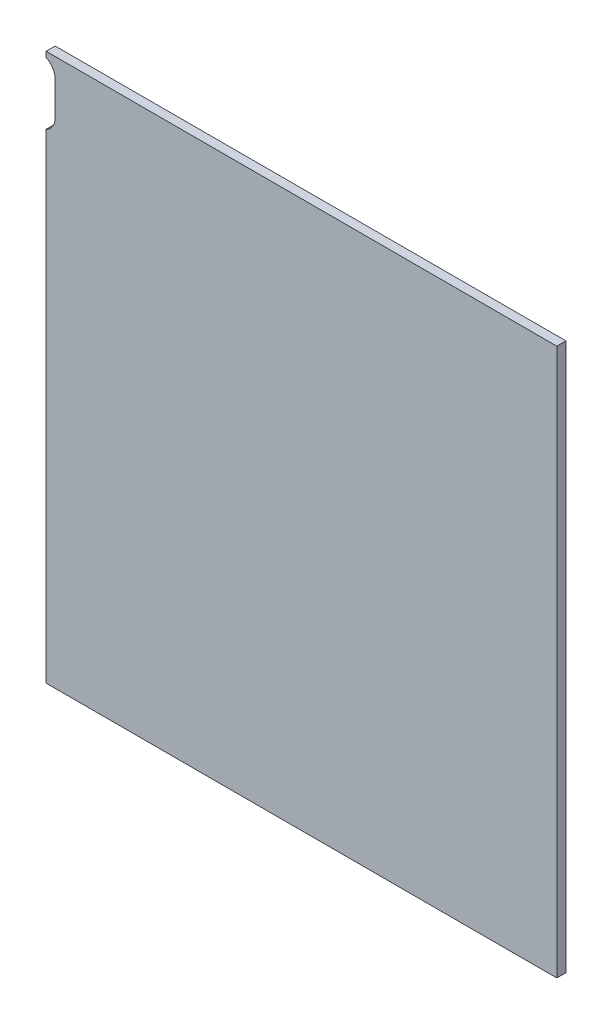
ISO-10303-21;
HEADER;
FILE_DESCRIPTION(('STEP AP214'),'2;1');
FILE_NAME('part.step','',(''),(''),'','','');
FILE_SCHEMA(('AUTOMOTIVE_DESIGN { 1 0 10303 214 1 1 1 1 }'));
ENDSEC;
DATA;
#1=APPLICATION_CONTEXT('core data for automotive mechanical design processes');
#2=APPLICATION_PROTOCOL_DEFINITION('international standard','automotive_design',2000,#1);
#3=PRODUCT_CONTEXT('',#1,'mechanical');
#4=PRODUCT('Part','Part','',(#3));
#5=PRODUCT_RELATED_PRODUCT_CATEGORY('part','',(#4));
#6=PRODUCT_DEFINITION_FORMATION('','',#4);
#7=PRODUCT_DEFINITION_CONTEXT('part definition',#1,'design');
#8=PRODUCT_DEFINITION('design','',#6,#7);
#9=PRODUCT_DEFINITION_SHAPE('','',#8);
#10=(LENGTH_UNIT() NAMED_UNIT(*) SI_UNIT(.MILLI.,.METRE.));
#11=(NAMED_UNIT(*) PLANE_ANGLE_UNIT() SI_UNIT($,.RADIAN.));
#12=(NAMED_UNIT(*) SI_UNIT($,.STERADIAN.) SOLID_ANGLE_UNIT());
#13=UNCERTAINTY_MEASURE_WITH_UNIT(LENGTH_MEASURE(1.E-05),#10,'distance_accuracy_value','');
#14=(GEOMETRIC_REPRESENTATION_CONTEXT(3) GLOBAL_UNCERTAINTY_ASSIGNED_CONTEXT((#13)) GLOBAL_UNIT_ASSIGNED_CONTEXT((#10,
#11,#12)) REPRESENTATION_CONTEXT('',''));
#15=CARTESIAN_POINT('',(0.,0.,0.));
#16=DIRECTION('',(0.,0.,1.));
#17=DIRECTION('',(1.,0.,0.));
#18=AXIS2_PLACEMENT_3D('',#15,#16,#17);
#19=CARTESIAN_POINT('',(0.,0.,0.));
#20=DIRECTION('',(0.,0.,-1.));
#21=DIRECTION('',(-1.,0.,0.));
#22=AXIS2_PLACEMENT_3D('',#19,#20,#21);
#23=PLANE('',#22);
#24=CARTESIAN_POINT('',(-144.,139.,0.));
#25=DIRECTION('',(0.,0.,1.));
#26=DIRECTION('',(1.,0.,0.));
#27=AXIS2_PLACEMENT_3D('',#24,#25,#26);
#28=CIRCLE('',#27,9.00000000000001);
#29=CARTESIAN_POINT('',(-135.,139.,0.));
#30=VERTEX_POINT('',#29);
#31=CARTESIAN_POINT('',(-140.,147.062257748299,0.));
#32=VERTEX_POINT('',#31);
#33=EDGE_CURVE('E185',#30,#32,#28,.T.);
#34=ORIENTED_EDGE('',*,*,#33,.T.);
#35=DIRECTION('',(0.,-1.,0.));
#36=VECTOR('',#35,1.);
#37=CARTESIAN_POINT('',(-140.,-150.,0.));
#38=LINE('',#37,#36);
#39=CARTESIAN_POINT('',(-140.,150.,0.));
#40=VERTEX_POINT('',#39);
#41=EDGE_CURVE('E224',#40,#32,#38,.T.);
#42=ORIENTED_EDGE('',*,*,#41,.F.);
#43=DIRECTION('',(-1.,0.,0.));
#44=VECTOR('',#43,1.);
#45=CARTESIAN_POINT('',(-140.,150.,0.));
#46=LINE('',#45,#44);
#47=CARTESIAN_POINT('',(140.,150.,0.));
#48=VERTEX_POINT('',#47);
#49=EDGE_CURVE('E221',#48,#40,#46,.T.);
#50=ORIENTED_EDGE('',*,*,#49,.F.);
#51=DIRECTION('',(0.,1.,0.));
#52=VECTOR('',#51,1.);
#53=CARTESIAN_POINT('',(140.,-150.,0.));
#54=LINE('',#53,#52);
#55=CARTESIAN_POINT('',(140.,-150.,0.));
#56=VERTEX_POINT('',#55);
#57=EDGE_CURVE('E205',#56,#48,#54,.T.);
#58=ORIENTED_EDGE('',*,*,#57,.F.);
#59=DIRECTION('',(1.,0.,0.));
#60=VECTOR('',#59,1.);
#61=CARTESIAN_POINT('',(-140.,-150.,0.));
#62=LINE('',#61,#60);
#63=CARTESIAN_POINT('',(-140.,-150.,0.));
#64=VERTEX_POINT('',#63);
#65=EDGE_CURVE('E210',#64,#56,#62,.T.);
#66=ORIENTED_EDGE('',*,*,#65,.F.);
#67=CARTESIAN_POINT('',(-140.,112.937742251701,0.));
#68=VERTEX_POINT('',#67);
#69=EDGE_CURVE('E223',#68,#64,#38,.T.);
#70=ORIENTED_EDGE('',*,*,#69,.F.);
#71=CARTESIAN_POINT('',(-144.,121.,0.));
#72=DIRECTION('',(0.,0.,-1.));
#73=DIRECTION('',(-1.,0.,0.));
#74=AXIS2_PLACEMENT_3D('',#71,#72,#73);
#75=CIRCLE('',#74,9.00000000000001);
#76=CARTESIAN_POINT('',(-135.,121.,0.));
#77=VERTEX_POINT('',#76);
#78=EDGE_CURVE('E11',#77,#68,#75,.T.);
#79=ORIENTED_EDGE('',*,*,#78,.F.);
#80=DIRECTION('',(0.,1.,0.));
#81=VECTOR('',#80,1.);
#82=CARTESIAN_POINT('',(-135.,139.,0.));
#83=LINE('',#82,#81);
#84=EDGE_CURVE('E56',#77,#30,#83,.T.);
#85=ORIENTED_EDGE('',*,*,#84,.T.);
#86=EDGE_LOOP('',(#34,#42,#50,#58,#66,#70,#79,#85));
#87=FACE_BOUND('',#86,.T.);
#88=DIRECTION('',(-0.976771023655525,-0.214285714285714,0.));
#89=VECTOR('',#88,1.);
#90=CARTESIAN_POINT('',(85.,-111.267710236555,0.));
#91=LINE('',#90,#89);
#92=CARTESIAN_POINT('',(85.,-111.267710236555,0.));
#93=VERTEX_POINT('',#92);
#94=CARTESIAN_POINT('',(16.6260283441133,-126.267710236555,0.));
#95=VERTEX_POINT('',#94);
#96=EDGE_CURVE('E163',#93,#95,#91,.T.);
#97=ORIENTED_EDGE('',*,*,#96,.F.);
#98=DIRECTION('',(0.214285714285715,-0.976771023655524,0.));
#99=VECTOR('',#98,1.);
#100=CARTESIAN_POINT('',(82.8571428571429,-101.5,0.));
#101=LINE('',#100,#99);
#102=CARTESIAN_POINT('',(82.8571428571429,-101.5,0.));
#103=VERTEX_POINT('',#102);
#104=EDGE_CURVE('E161',#103,#93,#101,.T.);
#105=ORIENTED_EDGE('',*,*,#104,.F.);
#106=DIRECTION('',(0.976771023655525,0.214285714285714,0.));
#107=VECTOR('',#106,1.);
#108=CARTESIAN_POINT('',(82.8571428571429,-101.5,0.));
#109=LINE('',#108,#107);
#110=CARTESIAN_POINT('',(14.4831712012562,-116.5,0.));
#111=VERTEX_POINT('',#110);
#112=EDGE_CURVE('E171',#111,#103,#109,.T.);
#113=ORIENTED_EDGE('',*,*,#112,.F.);
#114=DIRECTION('',(-0.214285714285713,0.976771023655525,0.));
#115=VECTOR('',#114,1.);
#116=CARTESIAN_POINT('',(14.4831712012562,-116.5,0.));
#117=LINE('',#116,#115);
#118=EDGE_CURVE('E174',#95,#111,#117,.T.);
#119=ORIENTED_EDGE('',*,*,#118,.F.);
#120=EDGE_LOOP('',(#97,#105,#113,#119));
#121=FACE_BOUND('',#120,.T.);
#122=ADVANCED_FACE('F33',(#87,#121),#23,.T.);
#123=CARTESIAN_POINT('',(-140.,-150.,5.));
#124=DIRECTION('',(1.,0.,0.));
#125=DIRECTION('',(0.,0.,-1.));
#126=AXIS2_PLACEMENT_3D('',#123,#124,#125);
#127=PLANE('',#126);
#128=ORIENTED_EDGE('',*,*,#41,.T.);
#129=DIRECTION('',(0.,0.,1.));
#130=VECTOR('',#129,1.);
#131=CARTESIAN_POINT('',(-140.,147.062257748299,0.));
#132=LINE('',#131,#130);
#133=CARTESIAN_POINT('',(-140.,147.062257748299,5.));
#134=VERTEX_POINT('',#133);
#135=EDGE_CURVE('E202',#32,#134,#132,.T.);
#136=ORIENTED_EDGE('',*,*,#135,.T.);
#137=DIRECTION('',(0.,-1.,0.));
#138=VECTOR('',#137,1.);
#139=CARTESIAN_POINT('',(-140.,-150.,5.));
#140=LINE('',#139,#138);
#141=CARTESIAN_POINT('',(-140.,150.,5.));
#142=VERTEX_POINT('',#141);
#143=EDGE_CURVE('E213',#142,#134,#140,.T.);
#144=ORIENTED_EDGE('',*,*,#143,.F.);
#145=DIRECTION('',(0.,0.,-1.));
#146=VECTOR('',#145,1.);
#147=CARTESIAN_POINT('',(-140.,150.,5.));
#148=LINE('',#147,#146);
#149=EDGE_CURVE('E233',#142,#40,#148,.T.);
#150=ORIENTED_EDGE('',*,*,#149,.T.);
#151=EDGE_LOOP('',(#128,#136,#144,#150));
#152=FACE_BOUND('',#151,.T.);
#153=ADVANCED_FACE('F251',(#152),#127,.F.);
#154=CARTESIAN_POINT('',(140.,-150.,5.));
#155=DIRECTION('',(-1.,0.,0.));
#156=DIRECTION('',(0.,0.,1.));
#157=AXIS2_PLACEMENT_3D('',#154,#155,#156);
#158=PLANE('',#157);
#159=ORIENTED_EDGE('',*,*,#57,.T.);
#160=DIRECTION('',(0.,0.,-1.));
#161=VECTOR('',#160,1.);
#162=CARTESIAN_POINT('',(140.,150.,5.));
#163=LINE('',#162,#161);
#164=CARTESIAN_POINT('',(140.,150.,5.));
#165=VERTEX_POINT('',#164);
#166=EDGE_CURVE('E41',#165,#48,#163,.T.);
#167=ORIENTED_EDGE('',*,*,#166,.F.);
#168=DIRECTION('',(0.,1.,0.));
#169=VECTOR('',#168,1.);
#170=CARTESIAN_POINT('',(140.,-150.,5.));
#171=LINE('',#170,#169);
#172=CARTESIAN_POINT('',(140.,-150.,5.));
#173=VERTEX_POINT('',#172);
#174=EDGE_CURVE('E206',#173,#165,#171,.T.);
#175=ORIENTED_EDGE('',*,*,#174,.F.);
#176=DIRECTION('',(0.,0.,-1.));
#177=VECTOR('',#176,1.);
#178=CARTESIAN_POINT('',(140.,-150.,5.));
#179=LINE('',#178,#177);
#180=EDGE_CURVE('E218',#173,#56,#179,.T.);
#181=ORIENTED_EDGE('',*,*,#180,.T.);
#182=EDGE_LOOP('',(#159,#167,#175,#181));
#183=FACE_BOUND('',#182,.T.);
#184=ADVANCED_FACE('F35',(#183),#158,.F.);
#185=CARTESIAN_POINT('',(-140.,150.,5.));
#186=DIRECTION('',(0.,-1.,0.));
#187=DIRECTION('',(0.,0.,-1.));
#188=AXIS2_PLACEMENT_3D('',#185,#186,#187);
#189=PLANE('',#188);
#190=ORIENTED_EDGE('',*,*,#49,.T.);
#191=ORIENTED_EDGE('',*,*,#149,.F.);
#192=DIRECTION('',(-1.,0.,0.));
#193=VECTOR('',#192,1.);
#194=CARTESIAN_POINT('',(-140.,150.,5.));
#195=LINE('',#194,#193);
#196=EDGE_CURVE('E209',#165,#142,#195,.T.);
#197=ORIENTED_EDGE('',*,*,#196,.F.);
#198=ORIENTED_EDGE('',*,*,#166,.T.);
#199=EDGE_LOOP('',(#190,#191,#197,#198));
#200=FACE_BOUND('',#199,.T.);
#201=ADVANCED_FACE('F238',(#200),#189,.F.);
#202=CARTESIAN_POINT('',(-140.,112.937742251701,5.));
#203=VERTEX_POINT('',#202);
#204=CARTESIAN_POINT('',(-140.,-150.,5.));
#205=VERTEX_POINT('',#204);
#206=EDGE_CURVE('E212',#203,#205,#140,.T.);
#207=ORIENTED_EDGE('',*,*,#206,.F.);
#208=DIRECTION('',(0.,0.,1.));
#209=VECTOR('',#208,1.);
#210=CARTESIAN_POINT('',(-140.,112.937742251701,0.));
#211=LINE('',#210,#209);
#212=EDGE_CURVE('E198',#203,#68,#211,.F.);
#213=ORIENTED_EDGE('',*,*,#212,.T.);
#214=ORIENTED_EDGE('',*,*,#69,.T.);
#215=DIRECTION('',(0.,0.,-1.));
#216=VECTOR('',#215,1.);
#217=CARTESIAN_POINT('',(-140.,-150.,5.));
#218=LINE('',#217,#216);
#219=EDGE_CURVE('E230',#205,#64,#218,.T.);
#220=ORIENTED_EDGE('',*,*,#219,.F.);
#221=EDGE_LOOP('',(#207,#213,#214,#220));
#222=FACE_BOUND('',#221,.T.);
#223=ADVANCED_FACE('F264',(#222),#127,.F.);
#224=CARTESIAN_POINT('',(-140.,-150.,5.));
#225=DIRECTION('',(0.,1.,0.));
#226=DIRECTION('',(0.,0.,1.));
#227=AXIS2_PLACEMENT_3D('',#224,#225,#226);
#228=PLANE('',#227);
#229=ORIENTED_EDGE('',*,*,#65,.T.);
#230=ORIENTED_EDGE('',*,*,#180,.F.);
#231=DIRECTION('',(1.,0.,0.));
#232=VECTOR('',#231,1.);
#233=CARTESIAN_POINT('',(-140.,-150.,5.));
#234=LINE('',#233,#232);
#235=EDGE_CURVE('E216',#205,#173,#234,.T.);
#236=ORIENTED_EDGE('',*,*,#235,.F.);
#237=ORIENTED_EDGE('',*,*,#219,.T.);
#238=EDGE_LOOP('',(#229,#230,#236,#237));
#239=FACE_BOUND('',#238,.T.);
#240=ADVANCED_FACE('F262',(#239),#228,.F.);
#241=CARTESIAN_POINT('',(0.,0.,5.));
#242=DIRECTION('',(0.,0.,-1.));
#243=DIRECTION('',(-1.,0.,0.));
#244=AXIS2_PLACEMENT_3D('',#241,#242,#243);
#245=PLANE('',#244);
#246=ORIENTED_EDGE('',*,*,#143,.T.);
#247=CARTESIAN_POINT('',(-144.,139.,5.));
#248=DIRECTION('',(0.,0.,1.));
#249=DIRECTION('',(1.,0.,0.));
#250=AXIS2_PLACEMENT_3D('',#247,#248,#249);
#251=CIRCLE('',#250,9.00000000000001);
#252=CARTESIAN_POINT('',(-135.,139.,5.));
#253=VERTEX_POINT('',#252);
#254=EDGE_CURVE('E184',#253,#134,#251,.T.);
#255=ORIENTED_EDGE('',*,*,#254,.F.);
#256=DIRECTION('',(0.,1.,0.));
#257=VECTOR('',#256,1.);
#258=CARTESIAN_POINT('',(-135.,139.,5.));
#259=LINE('',#258,#257);
#260=CARTESIAN_POINT('',(-135.,121.,5.));
#261=VERTEX_POINT('',#260);
#262=EDGE_CURVE('E188',#261,#253,#259,.T.);
#263=ORIENTED_EDGE('',*,*,#262,.F.);
#264=CARTESIAN_POINT('',(-144.,121.,5.));
#265=DIRECTION('',(0.,0.,1.));
#266=DIRECTION('',(1.,0.,0.));
#267=AXIS2_PLACEMENT_3D('',#264,#265,#266);
#268=CIRCLE('',#267,9.00000000000001);
#269=EDGE_CURVE('E192',#203,#261,#268,.T.);
#270=ORIENTED_EDGE('',*,*,#269,.F.);
#271=ORIENTED_EDGE('',*,*,#206,.T.);
#272=ORIENTED_EDGE('',*,*,#235,.T.);
#273=ORIENTED_EDGE('',*,*,#174,.T.);
#274=ORIENTED_EDGE('',*,*,#196,.T.);
#275=EDGE_LOOP('',(#246,#255,#263,#270,#271,#272,#273,#274));
#276=FACE_BOUND('',#275,.T.);
#277=ADVANCED_FACE('F255',(#276),#245,.F.);
#278=CARTESIAN_POINT('',(-144.,139.,0.));
#279=DIRECTION('',(0.,0.,1.));
#280=DIRECTION('',(1.,0.,0.));
#281=AXIS2_PLACEMENT_3D('',#278,#279,#280);
#282=CYLINDRICAL_SURFACE('',#281,9.00000000000001);
#283=ORIENTED_EDGE('',*,*,#33,.F.);
#284=DIRECTION('',(0.,0.,1.));
#285=VECTOR('',#284,1.);
#286=CARTESIAN_POINT('',(-135.,139.,0.));
#287=LINE('',#286,#285);
#288=EDGE_CURVE('E196',#30,#253,#287,.T.);
#289=ORIENTED_EDGE('',*,*,#288,.T.);
#290=ORIENTED_EDGE('',*,*,#254,.T.);
#291=ORIENTED_EDGE('',*,*,#135,.F.);
#292=EDGE_LOOP('',(#283,#289,#290,#291));
#293=FACE_BOUND('',#292,.T.);
#294=ADVANCED_FACE('F270',(#293),#282,.F.);
#295=CARTESIAN_POINT('',(-144.,121.,0.));
#296=DIRECTION('',(0.,0.,1.));
#297=DIRECTION('',(1.,0.,0.));
#298=AXIS2_PLACEMENT_3D('',#295,#296,#297);
#299=CYLINDRICAL_SURFACE('',#298,9.00000000000001);
#300=ORIENTED_EDGE('',*,*,#269,.T.);
#301=DIRECTION('',(0.,0.,1.));
#302=VECTOR('',#301,1.);
#303=CARTESIAN_POINT('',(-135.,121.,0.));
#304=LINE('',#303,#302);
#305=EDGE_CURVE('E190',#77,#261,#304,.T.);
#306=ORIENTED_EDGE('',*,*,#305,.F.);
#307=ORIENTED_EDGE('',*,*,#78,.T.);
#308=ORIENTED_EDGE('',*,*,#212,.F.);
#309=EDGE_LOOP('',(#300,#306,#307,#308));
#310=FACE_BOUND('',#309,.T.);
#311=ADVANCED_FACE('F267',(#310),#299,.F.);
#312=CARTESIAN_POINT('',(-135.,139.,0.));
#313=DIRECTION('',(1.,0.,0.));
#314=DIRECTION('',(0.,0.,-1.));
#315=AXIS2_PLACEMENT_3D('',#312,#313,#314);
#316=PLANE('',#315);
#317=ORIENTED_EDGE('',*,*,#262,.T.);
#318=ORIENTED_EDGE('',*,*,#288,.F.);
#319=ORIENTED_EDGE('',*,*,#84,.F.);
#320=ORIENTED_EDGE('',*,*,#305,.T.);
#321=EDGE_LOOP('',(#317,#318,#319,#320));
#322=FACE_BOUND('',#321,.T.);
#323=ADVANCED_FACE('F268',(#322),#316,.F.);
#324=CARTESIAN_POINT('',(82.8571428571429,-101.5,-7.));
#325=DIRECTION('',(-0.976771023655524,-0.214285714285715,0.));
#326=DIRECTION('',(0.214285714285715,-0.976771023655524,0.));
#327=AXIS2_PLACEMENT_3D('',#324,#325,#326);
#328=PLANE('',#327);
#329=ORIENTED_EDGE('',*,*,#104,.T.);
#330=DIRECTION('',(0.,0.,1.));
#331=VECTOR('',#330,1.);
#332=CARTESIAN_POINT('',(85.,-111.267710236555,-7.));
#333=LINE('',#332,#331);
#334=CARTESIAN_POINT('',(85.,-111.267710236555,-7.));
#335=VERTEX_POINT('',#334);
#336=EDGE_CURVE('E182',#335,#93,#333,.T.);
#337=ORIENTED_EDGE('',*,*,#336,.F.);
#338=DIRECTION('',(0.214285714285714,-0.976771023655525,0.));
#339=VECTOR('',#338,1.);
#340=CARTESIAN_POINT('',(82.8571428571429,-101.5,-7.));
#341=LINE('',#340,#339);
#342=CARTESIAN_POINT('',(86.0714285714286,-116.151565354833,-7.));
#343=VERTEX_POINT('',#342);
#344=EDGE_CURVE('E159',#335,#343,#341,.T.);
#345=ORIENTED_EDGE('',*,*,#344,.T.);
#346=DIRECTION('',(0.,0.,1.));
#347=VECTOR('',#346,1.);
#348=CARTESIAN_POINT('',(86.0714285714286,-116.151565354833,-12.));
#349=LINE('',#348,#347);
#350=CARTESIAN_POINT('',(86.0714285714286,-116.151565354833,-12.));
#351=VERTEX_POINT('',#350);
#352=EDGE_CURVE('E138',#351,#343,#349,.T.);
#353=ORIENTED_EDGE('',*,*,#352,.F.);
#354=DIRECTION('',(0.214285714285714,-0.976771023655525,0.));
#355=VECTOR('',#354,1.);
#356=CARTESIAN_POINT('',(82.8571428571429,-101.5,-12.));
#357=LINE('',#356,#355);
#358=CARTESIAN_POINT('',(82.8571428571429,-101.5,-12.));
#359=VERTEX_POINT('',#358);
#360=EDGE_CURVE('E145',#359,#351,#357,.T.);
#361=ORIENTED_EDGE('',*,*,#360,.F.);
#362=DIRECTION('',(0.,0.,1.));
#363=VECTOR('',#362,1.);
#364=CARTESIAN_POINT('',(82.8571428571429,-101.5,-7.));
#365=LINE('',#364,#363);
#366=EDGE_CURVE('E170',#359,#103,#365,.T.);
#367=ORIENTED_EDGE('',*,*,#366,.T.);
#368=EDGE_LOOP('',(#329,#337,#345,#353,#361,#367));
#369=FACE_BOUND('',#368,.T.);
#370=ADVANCED_FACE('F156',(#369),#328,.F.);
#371=CARTESIAN_POINT('',(85.,-111.267710236555,-7.));
#372=DIRECTION('',(-0.214285714285714,0.976771023655525,0.));
#373=DIRECTION('',(-0.976771023655525,-0.214285714285714,0.));
#374=AXIS2_PLACEMENT_3D('',#371,#372,#373);
#375=PLANE('',#374);
#376=ORIENTED_EDGE('',*,*,#96,.T.);
#377=DIRECTION('',(0.,0.,1.));
#378=VECTOR('',#377,1.);
#379=CARTESIAN_POINT('',(16.6260283441133,-126.267710236555,-7.));
#380=LINE('',#379,#378);
#381=CARTESIAN_POINT('',(16.6260283441133,-126.267710236555,-7.));
#382=VERTEX_POINT('',#381);
#383=EDGE_CURVE('E179',#382,#95,#380,.T.);
#384=ORIENTED_EDGE('',*,*,#383,.F.);
#385=DIRECTION('',(-0.976771023655525,-0.214285714285714,0.));
#386=VECTOR('',#385,1.);
#387=CARTESIAN_POINT('',(85.,-111.267710236555,-7.));
#388=LINE('',#387,#386);
#389=EDGE_CURVE('E168',#335,#382,#388,.T.);
#390=ORIENTED_EDGE('',*,*,#389,.F.);
#391=ORIENTED_EDGE('',*,*,#336,.T.);
#392=EDGE_LOOP('',(#376,#384,#390,#391));
#393=FACE_BOUND('',#392,.T.);
#394=ADVANCED_FACE('F346',(#393),#375,.F.);
#395=CARTESIAN_POINT('',(14.4831712012562,-116.5,-7.));
#396=DIRECTION('',(0.976771023655525,0.214285714285713,0.));
#397=DIRECTION('',(-0.214285714285713,0.976771023655525,0.));
#398=AXIS2_PLACEMENT_3D('',#395,#396,#397);
#399=PLANE('',#398);
#400=ORIENTED_EDGE('',*,*,#118,.T.);
#401=DIRECTION('',(0.,0.,1.));
#402=VECTOR('',#401,1.);
#403=CARTESIAN_POINT('',(14.4831712012562,-116.5,-7.));
#404=LINE('',#403,#402);
#405=CARTESIAN_POINT('',(14.4831712012562,-116.5,-12.));
#406=VERTEX_POINT('',#405);
#407=EDGE_CURVE('E48',#406,#111,#404,.T.);
#408=ORIENTED_EDGE('',*,*,#407,.F.);
#409=DIRECTION('',(-0.214285714285713,0.976771023655525,0.));
#410=VECTOR('',#409,1.);
#411=CARTESIAN_POINT('',(14.4831712012562,-116.5,-12.));
#412=LINE('',#411,#410);
#413=CARTESIAN_POINT('',(17.6974569155419,-131.151565354833,-12.));
#414=VERTEX_POINT('',#413);
#415=EDGE_CURVE('E144',#414,#406,#412,.T.);
#416=ORIENTED_EDGE('',*,*,#415,.F.);
#417=DIRECTION('',(0.,0.,1.));
#418=VECTOR('',#417,1.);
#419=CARTESIAN_POINT('',(17.6974569155419,-131.151565354833,-12.));
#420=LINE('',#419,#418);
#421=CARTESIAN_POINT('',(17.6974569155419,-131.151565354833,-7.));
#422=VERTEX_POINT('',#421);
#423=EDGE_CURVE('E140',#414,#422,#420,.T.);
#424=ORIENTED_EDGE('',*,*,#423,.T.);
#425=DIRECTION('',(-0.214285714285713,0.976771023655525,0.));
#426=VECTOR('',#425,1.);
#427=CARTESIAN_POINT('',(14.4831712012562,-116.5,-7.));
#428=LINE('',#427,#426);
#429=EDGE_CURVE('E153',#422,#382,#428,.T.);
#430=ORIENTED_EDGE('',*,*,#429,.T.);
#431=ORIENTED_EDGE('',*,*,#383,.T.);
#432=EDGE_LOOP('',(#400,#408,#416,#424,#430,#431));
#433=FACE_BOUND('',#432,.T.);
#434=ADVANCED_FACE('F357',(#433),#399,.F.);
#435=CARTESIAN_POINT('',(82.8571428571429,-101.5,-7.));
#436=DIRECTION('',(0.214285714285714,-0.976771023655525,0.));
#437=DIRECTION('',(0.976771023655525,0.214285714285714,0.));
#438=AXIS2_PLACEMENT_3D('',#435,#436,#437);
#439=PLANE('',#438);
#440=ORIENTED_EDGE('',*,*,#112,.T.);
#441=ORIENTED_EDGE('',*,*,#366,.F.);
#442=DIRECTION('',(0.976771023655525,0.214285714285714,0.));
#443=VECTOR('',#442,1.);
#444=CARTESIAN_POINT('',(82.8571428571429,-101.5,-12.));
#445=LINE('',#444,#443);
#446=EDGE_CURVE('E150',#406,#359,#445,.T.);
#447=ORIENTED_EDGE('',*,*,#446,.F.);
#448=ORIENTED_EDGE('',*,*,#407,.T.);
#449=EDGE_LOOP('',(#440,#441,#447,#448));
#450=FACE_BOUND('',#449,.T.);
#451=ADVANCED_FACE('F367',(#450),#439,.F.);
#452=CARTESIAN_POINT('',(0.,0.,-7.));
#453=DIRECTION('',(0.,0.,-1.));
#454=DIRECTION('',(-1.,0.,0.));
#455=AXIS2_PLACEMENT_3D('',#452,#453,#454);
#456=PLANE('',#455);
#457=ORIENTED_EDGE('',*,*,#344,.F.);
#458=ORIENTED_EDGE('',*,*,#389,.T.);
#459=ORIENTED_EDGE('',*,*,#429,.F.);
#460=DIRECTION('',(-0.976771023655524,-0.214285714285714,0.));
#461=VECTOR('',#460,1.);
#462=CARTESIAN_POINT('',(86.0714285714286,-116.151565354833,-7.));
#463=LINE('',#462,#461);
#464=EDGE_CURVE('E408',#343,#422,#463,.T.);
#465=ORIENTED_EDGE('',*,*,#464,.F.);
#466=EDGE_LOOP('',(#457,#458,#459,#465));
#467=FACE_BOUND('',#466,.T.);
#468=ADVANCED_FACE('F377',(#467),#456,.F.);
#469=CARTESIAN_POINT('',(86.0714285714286,-116.151565354833,-12.));
#470=DIRECTION('',(-0.214285714285714,0.976771023655524,0.));
#471=DIRECTION('',(-0.976771023655525,-0.214285714285714,0.));
#472=AXIS2_PLACEMENT_3D('',#469,#470,#471);
#473=PLANE('',#472);
#474=ORIENTED_EDGE('',*,*,#464,.T.);
#475=ORIENTED_EDGE('',*,*,#423,.F.);
#476=DIRECTION('',(-0.976771023655524,-0.214285714285714,0.));
#477=VECTOR('',#476,1.);
#478=CARTESIAN_POINT('',(86.0714285714286,-116.151565354833,-12.));
#479=LINE('',#478,#477);
#480=EDGE_CURVE('E134',#351,#414,#479,.T.);
#481=ORIENTED_EDGE('',*,*,#480,.F.);
#482=ORIENTED_EDGE('',*,*,#352,.T.);
#483=EDGE_LOOP('',(#474,#475,#481,#482));
#484=FACE_BOUND('',#483,.T.);
#485=ADVANCED_FACE('F136',(#484),#473,.F.);
#486=CARTESIAN_POINT('',(0.,0.,-12.));
#487=DIRECTION('',(0.,0.,-1.));
#488=DIRECTION('',(-1.,0.,0.));
#489=AXIS2_PLACEMENT_3D('',#486,#487,#488);
#490=PLANE('',#489);
#491=ORIENTED_EDGE('',*,*,#360,.T.);
#492=ORIENTED_EDGE('',*,*,#480,.T.);
#493=ORIENTED_EDGE('',*,*,#415,.T.);
#494=ORIENTED_EDGE('',*,*,#446,.T.);
#495=EDGE_LOOP('',(#491,#492,#493,#494));
#496=FACE_BOUND('',#495,.T.);
#497=ADVANCED_FACE('F149',(#496),#490,.T.);
#498=CLOSED_SHELL('',(#122,#153,#184,#201,#223,#240,#277,#294,#311,#323,#370,#394,#434,#451,
#468,#485,#497));
#499=MANIFOLD_SOLID_BREP('B2',#498);
#500=ADVANCED_BREP_SHAPE_REPRESENTATION('',(#18,#499),#14);
#501=SHAPE_DEFINITION_REPRESENTATION(#9,#500);
ENDSEC;
END-ISO-10303-21;
